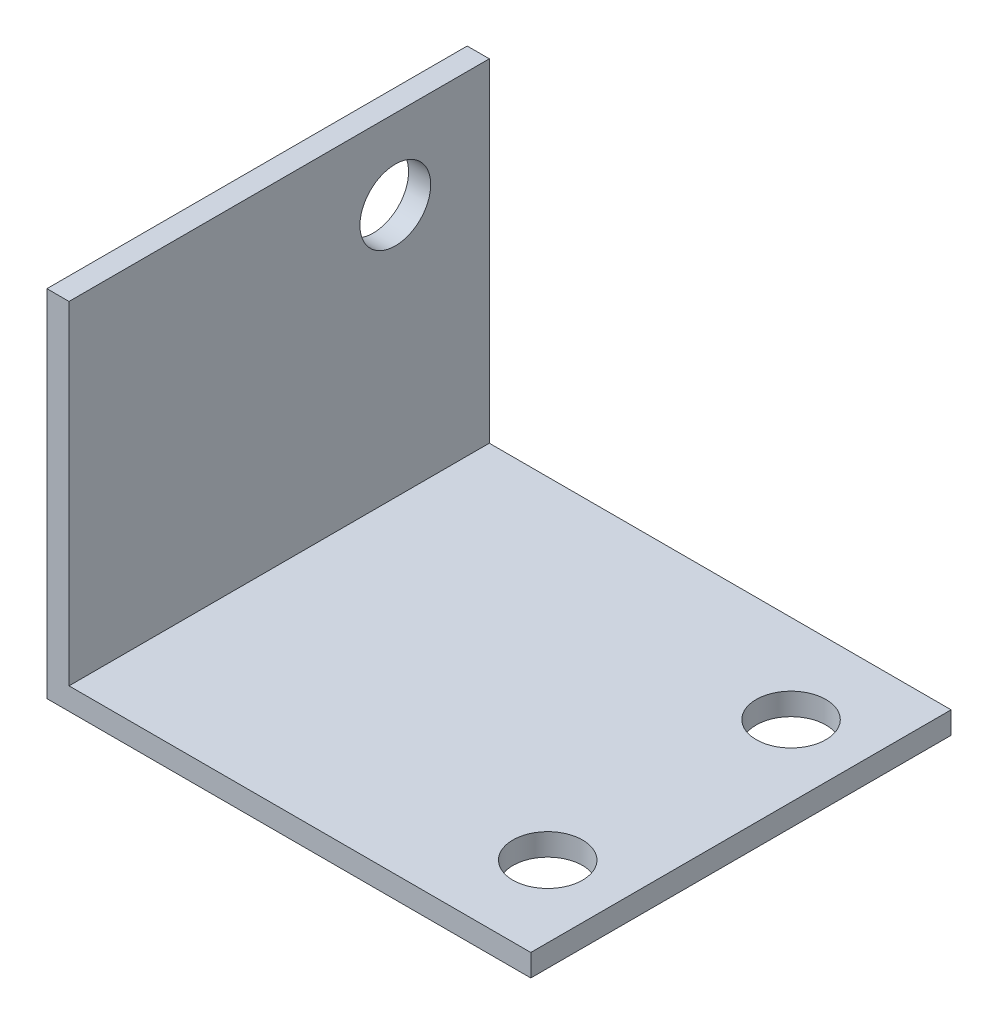
ISO-10303-21;
HEADER;
FILE_DESCRIPTION(('STEP AP214'),'2;1');
FILE_NAME('part.step','',(''),(''),'','','');
FILE_SCHEMA(('AUTOMOTIVE_DESIGN { 1 0 10303 214 1 1 1 1 }'));
ENDSEC;
DATA;
#1=APPLICATION_CONTEXT('core data for automotive mechanical design processes');
#2=APPLICATION_PROTOCOL_DEFINITION('international standard','automotive_design',2000,#1);
#3=PRODUCT_CONTEXT('',#1,'mechanical');
#4=PRODUCT('Part','Part','',(#3));
#5=PRODUCT_RELATED_PRODUCT_CATEGORY('part','',(#4));
#6=PRODUCT_DEFINITION_FORMATION('','',#4);
#7=PRODUCT_DEFINITION_CONTEXT('part definition',#1,'design');
#8=PRODUCT_DEFINITION('design','',#6,#7);
#9=PRODUCT_DEFINITION_SHAPE('','',#8);
#10=(LENGTH_UNIT() NAMED_UNIT(*) SI_UNIT(.MILLI.,.METRE.));
#11=(NAMED_UNIT(*) PLANE_ANGLE_UNIT() SI_UNIT($,.RADIAN.));
#12=(NAMED_UNIT(*) SI_UNIT($,.STERADIAN.) SOLID_ANGLE_UNIT());
#13=UNCERTAINTY_MEASURE_WITH_UNIT(LENGTH_MEASURE(1.E-05),#10,'distance_accuracy_value','');
#14=(GEOMETRIC_REPRESENTATION_CONTEXT(3) GLOBAL_UNCERTAINTY_ASSIGNED_CONTEXT((#13)) GLOBAL_UNIT_ASSIGNED_CONTEXT((#10,
#11,#12)) REPRESENTATION_CONTEXT('',''));
#15=CARTESIAN_POINT('',(0.,0.,0.));
#16=DIRECTION('',(0.,0.,1.));
#17=DIRECTION('',(1.,0.,0.));
#18=AXIS2_PLACEMENT_3D('',#15,#16,#17);
#19=CARTESIAN_POINT('',(0.,2.,0.));
#20=DIRECTION('',(0.,1.,0.));
#21=DIRECTION('',(0.,0.,1.));
#22=AXIS2_PLACEMENT_3D('',#19,#20,#21);
#23=PLANE('',#22);
#24=DIRECTION('',(0.,0.,-1.));
#25=VECTOR('',#24,1.);
#26=CARTESIAN_POINT('',(-19.875,2.,0.));
#27=LINE('',#26,#25);
#28=CARTESIAN_POINT('',(-19.875,2.,19.));
#29=VERTEX_POINT('',#28);
#30=CARTESIAN_POINT('',(-19.875,2.,-19.));
#31=VERTEX_POINT('',#30);
#32=EDGE_CURVE('E51',#29,#31,#27,.T.);
#33=ORIENTED_EDGE('',*,*,#32,.F.);
#34=DIRECTION('',(1.,0.,0.));
#35=VECTOR('',#34,1.);
#36=CARTESIAN_POINT('',(-21.875,2.,19.));
#37=LINE('',#36,#35);
#38=CARTESIAN_POINT('',(21.875,2.,19.));
#39=VERTEX_POINT('',#38);
#40=EDGE_CURVE('E90',#29,#39,#37,.T.);
#41=ORIENTED_EDGE('',*,*,#40,.T.);
#42=DIRECTION('',(0.,0.,-1.));
#43=VECTOR('',#42,1.);
#44=CARTESIAN_POINT('',(21.875,2.,-19.));
#45=LINE('',#44,#43);
#46=CARTESIAN_POINT('',(21.875,2.,-19.));
#47=VERTEX_POINT('',#46);
#48=EDGE_CURVE('E127',#39,#47,#45,.T.);
#49=ORIENTED_EDGE('',*,*,#48,.T.);
#50=DIRECTION('',(-1.,0.,0.));
#51=VECTOR('',#50,1.);
#52=CARTESIAN_POINT('',(-21.875,2.,-19.));
#53=LINE('',#52,#51);
#54=EDGE_CURVE('E47',#47,#31,#53,.T.);
#55=ORIENTED_EDGE('',*,*,#54,.T.);
#56=EDGE_LOOP('',(#33,#41,#49,#55));
#57=FACE_BOUND('',#56,.T.);
#58=CARTESIAN_POINT('',(15.405,2.,-11.));
#59=DIRECTION('',(0.,1.,0.));
#60=DIRECTION('',(0.,0.,1.));
#61=AXIS2_PLACEMENT_3D('',#58,#59,#60);
#62=CIRCLE('',#61,3.15);
#63=CARTESIAN_POINT('',(15.405,2.,-7.85));
#64=VERTEX_POINT('',#63);
#65=EDGE_CURVE('E121',#64,#64,#62,.T.);
#66=ORIENTED_EDGE('',*,*,#65,.F.);
#67=EDGE_LOOP('',(#66));
#68=FACE_BOUND('',#67,.T.);
#69=CARTESIAN_POINT('',(15.405,2.,11.));
#70=DIRECTION('',(0.,1.,0.));
#71=DIRECTION('',(0.,0.,1.));
#72=AXIS2_PLACEMENT_3D('',#69,#70,#71);
#73=CIRCLE('',#72,3.15);
#74=CARTESIAN_POINT('',(15.405,2.,14.15));
#75=VERTEX_POINT('',#74);
#76=EDGE_CURVE('E115',#75,#75,#73,.T.);
#77=ORIENTED_EDGE('',*,*,#76,.F.);
#78=EDGE_LOOP('',(#77));
#79=FACE_BOUND('',#78,.T.);
#80=ADVANCED_FACE('F32',(#57,#68,#79),#23,.T.);
#81=CARTESIAN_POINT('',(0.,0.,0.));
#82=DIRECTION('',(0.,1.,0.));
#83=DIRECTION('',(0.,0.,1.));
#84=AXIS2_PLACEMENT_3D('',#81,#82,#83);
#85=PLANE('',#84);
#86=CARTESIAN_POINT('',(15.405,0.,-11.));
#87=DIRECTION('',(0.,1.,0.));
#88=DIRECTION('',(0.,0.,1.));
#89=AXIS2_PLACEMENT_3D('',#86,#87,#88);
#90=CIRCLE('',#89,3.15);
#91=CARTESIAN_POINT('',(15.405,0.,-7.85));
#92=VERTEX_POINT('',#91);
#93=EDGE_CURVE('E118',#92,#92,#90,.T.);
#94=ORIENTED_EDGE('',*,*,#93,.T.);
#95=EDGE_LOOP('',(#94));
#96=FACE_BOUND('',#95,.T.);
#97=DIRECTION('',(0.,0.,-1.));
#98=VECTOR('',#97,1.);
#99=CARTESIAN_POINT('',(21.875,0.,-19.));
#100=LINE('',#99,#98);
#101=CARTESIAN_POINT('',(21.875,0.,19.));
#102=VERTEX_POINT('',#101);
#103=CARTESIAN_POINT('',(21.875,0.,-19.));
#104=VERTEX_POINT('',#103);
#105=EDGE_CURVE('E124',#102,#104,#100,.T.);
#106=ORIENTED_EDGE('',*,*,#105,.F.);
#107=DIRECTION('',(1.,0.,0.));
#108=VECTOR('',#107,1.);
#109=CARTESIAN_POINT('',(-21.875,0.,19.));
#110=LINE('',#109,#108);
#111=CARTESIAN_POINT('',(-21.875,0.,19.));
#112=VERTEX_POINT('',#111);
#113=EDGE_CURVE('E129',#112,#102,#110,.T.);
#114=ORIENTED_EDGE('',*,*,#113,.F.);
#115=DIRECTION('',(0.,0.,1.));
#116=VECTOR('',#115,1.);
#117=CARTESIAN_POINT('',(-21.875,0.,-19.));
#118=LINE('',#117,#116);
#119=CARTESIAN_POINT('',(-21.875,0.,-19.));
#120=VERTEX_POINT('',#119);
#121=EDGE_CURVE('E137',#120,#112,#118,.T.);
#122=ORIENTED_EDGE('',*,*,#121,.F.);
#123=DIRECTION('',(-1.,0.,0.));
#124=VECTOR('',#123,1.);
#125=CARTESIAN_POINT('',(-21.875,0.,-19.));
#126=LINE('',#125,#124);
#127=EDGE_CURVE('E135',#104,#120,#126,.T.);
#128=ORIENTED_EDGE('',*,*,#127,.F.);
#129=EDGE_LOOP('',(#106,#114,#122,#128));
#130=FACE_BOUND('',#129,.T.);
#131=CARTESIAN_POINT('',(15.405,0.,11.));
#132=DIRECTION('',(0.,1.,0.));
#133=DIRECTION('',(0.,0.,1.));
#134=AXIS2_PLACEMENT_3D('',#131,#132,#133);
#135=CIRCLE('',#134,3.15);
#136=CARTESIAN_POINT('',(15.405,0.,14.15));
#137=VERTEX_POINT('',#136);
#138=EDGE_CURVE('E114',#137,#137,#135,.T.);
#139=ORIENTED_EDGE('',*,*,#138,.T.);
#140=EDGE_LOOP('',(#139));
#141=FACE_BOUND('',#140,.T.);
#142=ADVANCED_FACE('F152',(#96,#130,#141),#85,.F.);
#143=CARTESIAN_POINT('',(21.875,2.,-19.));
#144=DIRECTION('',(-1.,0.,0.));
#145=DIRECTION('',(0.,0.,1.));
#146=AXIS2_PLACEMENT_3D('',#143,#144,#145);
#147=PLANE('',#146);
#148=ORIENTED_EDGE('',*,*,#105,.T.);
#149=DIRECTION('',(0.,-1.,0.));
#150=VECTOR('',#149,1.);
#151=CARTESIAN_POINT('',(21.875,2.,-19.));
#152=LINE('',#151,#150);
#153=EDGE_CURVE('E11',#47,#104,#152,.T.);
#154=ORIENTED_EDGE('',*,*,#153,.F.);
#155=ORIENTED_EDGE('',*,*,#48,.F.);
#156=DIRECTION('',(0.,-1.,0.));
#157=VECTOR('',#156,1.);
#158=CARTESIAN_POINT('',(21.875,2.,19.));
#159=LINE('',#158,#157);
#160=EDGE_CURVE('E132',#39,#102,#159,.T.);
#161=ORIENTED_EDGE('',*,*,#160,.T.);
#162=EDGE_LOOP('',(#148,#154,#155,#161));
#163=FACE_BOUND('',#162,.T.);
#164=ADVANCED_FACE('F34',(#163),#147,.F.);
#165=CARTESIAN_POINT('',(-21.875,2.,-19.));
#166=DIRECTION('',(0.,0.,1.));
#167=DIRECTION('',(1.,0.,0.));
#168=AXIS2_PLACEMENT_3D('',#165,#166,#167);
#169=PLANE('',#168);
#170=ORIENTED_EDGE('',*,*,#127,.T.);
#171=DIRECTION('',(0.,-1.,0.));
#172=VECTOR('',#171,1.);
#173=CARTESIAN_POINT('',(-21.875,2.,-19.));
#174=LINE('',#173,#172);
#175=CARTESIAN_POINT('',(-21.875,32.1,-19.));
#176=VERTEX_POINT('',#175);
#177=EDGE_CURVE('E40',#176,#120,#174,.T.);
#178=ORIENTED_EDGE('',*,*,#177,.F.);
#179=DIRECTION('',(-1.,0.,0.));
#180=VECTOR('',#179,1.);
#181=CARTESIAN_POINT('',(-19.875,32.1,-19.));
#182=LINE('',#181,#180);
#183=CARTESIAN_POINT('',(-19.875,32.1,-19.));
#184=VERTEX_POINT('',#183);
#185=EDGE_CURVE('E102',#184,#176,#182,.T.);
#186=ORIENTED_EDGE('',*,*,#185,.F.);
#187=DIRECTION('',(0.,-1.,0.));
#188=VECTOR('',#187,1.);
#189=CARTESIAN_POINT('',(-19.875,0.,-19.));
#190=LINE('',#189,#188);
#191=EDGE_CURVE('E94',#184,#31,#190,.T.);
#192=ORIENTED_EDGE('',*,*,#191,.T.);
#193=ORIENTED_EDGE('',*,*,#54,.F.);
#194=ORIENTED_EDGE('',*,*,#153,.T.);
#195=EDGE_LOOP('',(#170,#178,#186,#192,#193,#194));
#196=FACE_BOUND('',#195,.T.);
#197=ADVANCED_FACE('F176',(#196),#169,.F.);
#198=CARTESIAN_POINT('',(-21.875,2.,-19.));
#199=DIRECTION('',(1.,0.,0.));
#200=DIRECTION('',(0.,0.,-1.));
#201=AXIS2_PLACEMENT_3D('',#198,#199,#200);
#202=PLANE('',#201);
#203=ORIENTED_EDGE('',*,*,#121,.T.);
#204=DIRECTION('',(0.,-1.,0.));
#205=VECTOR('',#204,1.);
#206=CARTESIAN_POINT('',(-21.875,2.,19.));
#207=LINE('',#206,#205);
#208=CARTESIAN_POINT('',(-21.875,32.1,19.));
#209=VERTEX_POINT('',#208);
#210=EDGE_CURVE('E142',#209,#112,#207,.T.);
#211=ORIENTED_EDGE('',*,*,#210,.F.);
#212=DIRECTION('',(0.,0.,-1.));
#213=VECTOR('',#212,1.);
#214=CARTESIAN_POINT('',(-21.875,32.1,-19.));
#215=LINE('',#214,#213);
#216=EDGE_CURVE('E101',#209,#176,#215,.T.);
#217=ORIENTED_EDGE('',*,*,#216,.T.);
#218=ORIENTED_EDGE('',*,*,#177,.T.);
#219=EDGE_LOOP('',(#203,#211,#217,#218));
#220=FACE_BOUND('',#219,.T.);
#221=CARTESIAN_POINT('',(-21.875,24.9,-10.5));
#222=DIRECTION('',(-1.,0.,0.));
#223=DIRECTION('',(0.,0.,1.));
#224=AXIS2_PLACEMENT_3D('',#221,#222,#223);
#225=CIRCLE('',#224,3.2);
#226=CARTESIAN_POINT('',(-21.875,24.9,-7.29999999999999));
#227=VERTEX_POINT('',#226);
#228=EDGE_CURVE('E186',#227,#227,#225,.T.);
#229=ORIENTED_EDGE('',*,*,#228,.F.);
#230=EDGE_LOOP('',(#229));
#231=FACE_BOUND('',#230,.T.);
#232=ADVANCED_FACE('F146',(#220,#231),#202,.F.);
#233=CARTESIAN_POINT('',(-21.875,2.,19.));
#234=DIRECTION('',(0.,0.,-1.));
#235=DIRECTION('',(-1.,0.,0.));
#236=AXIS2_PLACEMENT_3D('',#233,#234,#235);
#237=PLANE('',#236);
#238=ORIENTED_EDGE('',*,*,#40,.F.);
#239=DIRECTION('',(0.,1.,0.));
#240=VECTOR('',#239,1.);
#241=CARTESIAN_POINT('',(-19.875,0.,19.));
#242=LINE('',#241,#240);
#243=CARTESIAN_POINT('',(-19.875,32.1,19.));
#244=VERTEX_POINT('',#243);
#245=EDGE_CURVE('E83',#29,#244,#242,.T.);
#246=ORIENTED_EDGE('',*,*,#245,.T.);
#247=DIRECTION('',(-1.,0.,0.));
#248=VECTOR('',#247,1.);
#249=CARTESIAN_POINT('',(-19.875,32.1,19.));
#250=LINE('',#249,#248);
#251=EDGE_CURVE('E87',#244,#209,#250,.T.);
#252=ORIENTED_EDGE('',*,*,#251,.T.);
#253=ORIENTED_EDGE('',*,*,#210,.T.);
#254=ORIENTED_EDGE('',*,*,#113,.T.);
#255=ORIENTED_EDGE('',*,*,#160,.F.);
#256=EDGE_LOOP('',(#238,#246,#252,#253,#254,#255));
#257=FACE_BOUND('',#256,.T.);
#258=ADVANCED_FACE('F85',(#257),#237,.F.);
#259=CARTESIAN_POINT('',(15.405,2.,-11.));
#260=DIRECTION('',(0.,-1.,0.));
#261=DIRECTION('',(0.,0.,-1.));
#262=AXIS2_PLACEMENT_3D('',#259,#260,#261);
#263=CYLINDRICAL_SURFACE('',#262,3.15);
#264=ORIENTED_EDGE('',*,*,#65,.T.);
#265=EDGE_LOOP('',(#264));
#266=FACE_BOUND('',#265,.T.);
#267=ORIENTED_EDGE('',*,*,#93,.F.);
#268=EDGE_LOOP('',(#267));
#269=FACE_BOUND('',#268,.T.);
#270=ADVANCED_FACE('F167',(#266,#269),#263,.F.);
#271=CARTESIAN_POINT('',(15.405,2.,11.));
#272=DIRECTION('',(0.,-1.,0.));
#273=DIRECTION('',(0.,0.,-1.));
#274=AXIS2_PLACEMENT_3D('',#271,#272,#273);
#275=CYLINDRICAL_SURFACE('',#274,3.15);
#276=ORIENTED_EDGE('',*,*,#76,.T.);
#277=EDGE_LOOP('',(#276));
#278=FACE_BOUND('',#277,.T.);
#279=ORIENTED_EDGE('',*,*,#138,.F.);
#280=EDGE_LOOP('',(#279));
#281=FACE_BOUND('',#280,.T.);
#282=ADVANCED_FACE('F164',(#278,#281),#275,.F.);
#283=CARTESIAN_POINT('',(-19.875,32.1,-19.));
#284=DIRECTION('',(0.,1.,0.));
#285=DIRECTION('',(0.,0.,1.));
#286=AXIS2_PLACEMENT_3D('',#283,#284,#285);
#287=PLANE('',#286);
#288=ORIENTED_EDGE('',*,*,#216,.F.);
#289=ORIENTED_EDGE('',*,*,#251,.F.);
#290=DIRECTION('',(0.,0.,-1.));
#291=VECTOR('',#290,1.);
#292=CARTESIAN_POINT('',(-19.875,32.1,-19.));
#293=LINE('',#292,#291);
#294=EDGE_CURVE('E93',#244,#184,#293,.T.);
#295=ORIENTED_EDGE('',*,*,#294,.T.);
#296=ORIENTED_EDGE('',*,*,#185,.T.);
#297=EDGE_LOOP('',(#288,#289,#295,#296));
#298=FACE_BOUND('',#297,.T.);
#299=ADVANCED_FACE('F98',(#298),#287,.T.);
#300=CARTESIAN_POINT('',(-19.875,0.,0.));
#301=DIRECTION('',(1.,0.,0.));
#302=DIRECTION('',(0.,0.,-1.));
#303=AXIS2_PLACEMENT_3D('',#300,#301,#302);
#304=PLANE('',#303);
#305=CARTESIAN_POINT('',(-19.875,24.9,-10.5));
#306=DIRECTION('',(-1.,0.,0.));
#307=DIRECTION('',(0.,0.,1.));
#308=AXIS2_PLACEMENT_3D('',#305,#306,#307);
#309=CIRCLE('',#308,3.2);
#310=CARTESIAN_POINT('',(-19.875,24.9,-7.29999999999999));
#311=VERTEX_POINT('',#310);
#312=EDGE_CURVE('E111',#311,#311,#309,.T.);
#313=ORIENTED_EDGE('',*,*,#312,.T.);
#314=EDGE_LOOP('',(#313));
#315=FACE_BOUND('',#314,.T.);
#316=ORIENTED_EDGE('',*,*,#245,.F.);
#317=ORIENTED_EDGE('',*,*,#32,.T.);
#318=ORIENTED_EDGE('',*,*,#191,.F.);
#319=ORIENTED_EDGE('',*,*,#294,.F.);
#320=EDGE_LOOP('',(#316,#317,#318,#319));
#321=FACE_BOUND('',#320,.T.);
#322=ADVANCED_FACE('F105',(#315,#321),#304,.T.);
#323=CARTESIAN_POINT('',(-19.875,24.9,-10.5));
#324=DIRECTION('',(-1.,0.,0.));
#325=DIRECTION('',(0.,0.,1.));
#326=AXIS2_PLACEMENT_3D('',#323,#324,#325);
#327=CYLINDRICAL_SURFACE('',#326,3.2);
#328=ORIENTED_EDGE('',*,*,#312,.F.);
#329=EDGE_LOOP('',(#328));
#330=FACE_BOUND('',#329,.T.);
#331=ORIENTED_EDGE('',*,*,#228,.T.);
#332=EDGE_LOOP('',(#331));
#333=FACE_BOUND('',#332,.T.);
#334=ADVANCED_FACE('F193',(#330,#333),#327,.F.);
#335=CLOSED_SHELL('',(#80,#142,#164,#197,#232,#258,#270,#282,#299,#322,#334));
#336=MANIFOLD_SOLID_BREP('B2',#335);
#337=ADVANCED_BREP_SHAPE_REPRESENTATION('',(#18,#336),#14);
#338=SHAPE_DEFINITION_REPRESENTATION(#9,#337);
ENDSEC;
END-ISO-10303-21;
